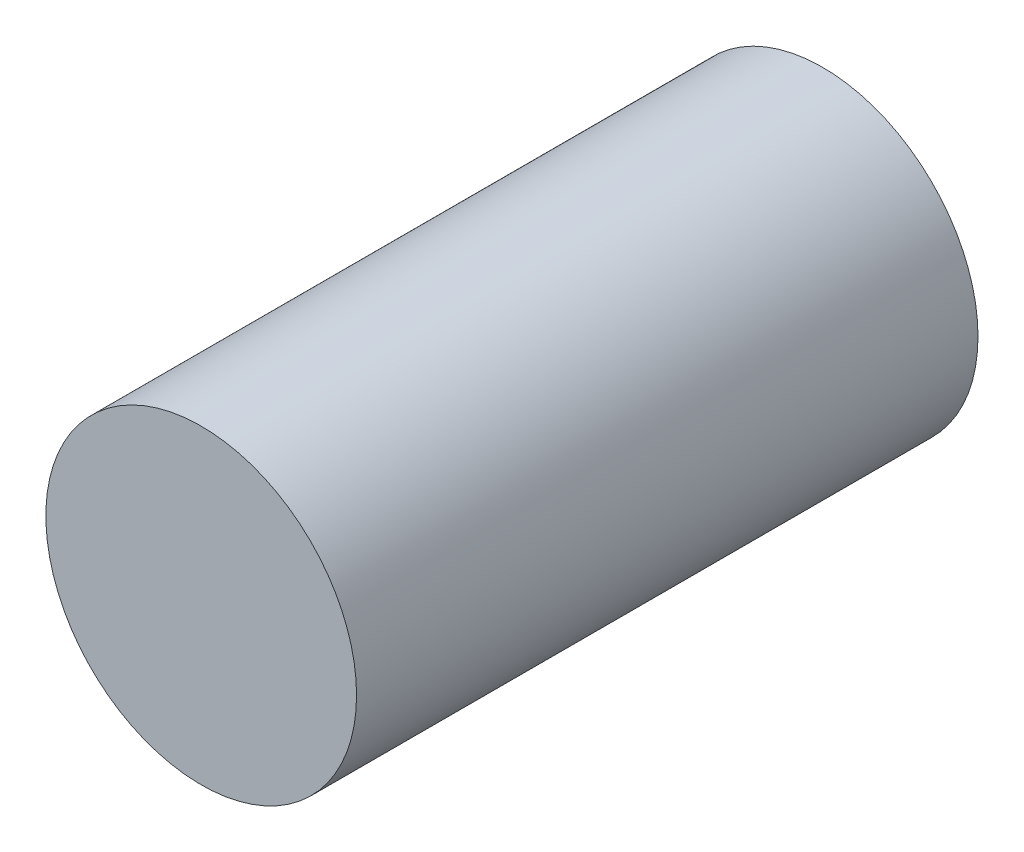
ISO-10303-21;
HEADER;
FILE_DESCRIPTION(('STEP AP214'),'2;1');
FILE_NAME('part.step','',(''),(''),'','','');
FILE_SCHEMA(('AUTOMOTIVE_DESIGN { 1 0 10303 214 1 1 1 1 }'));
ENDSEC;
DATA;
#1=APPLICATION_CONTEXT('core data for automotive mechanical design processes');
#2=APPLICATION_PROTOCOL_DEFINITION('international standard','automotive_design',2000,#1);
#3=PRODUCT_CONTEXT('',#1,'mechanical');
#4=PRODUCT('Part','Part','',(#3));
#5=PRODUCT_RELATED_PRODUCT_CATEGORY('part','',(#4));
#6=PRODUCT_DEFINITION_FORMATION('','',#4);
#7=PRODUCT_DEFINITION_CONTEXT('part definition',#1,'design');
#8=PRODUCT_DEFINITION('design','',#6,#7);
#9=PRODUCT_DEFINITION_SHAPE('','',#8);
#10=(LENGTH_UNIT() NAMED_UNIT(*) SI_UNIT(.MILLI.,.METRE.));
#11=(NAMED_UNIT(*) PLANE_ANGLE_UNIT() SI_UNIT($,.RADIAN.));
#12=(NAMED_UNIT(*) SI_UNIT($,.STERADIAN.) SOLID_ANGLE_UNIT());
#13=UNCERTAINTY_MEASURE_WITH_UNIT(LENGTH_MEASURE(1.E-05),#10,'distance_accuracy_value','');
#14=(GEOMETRIC_REPRESENTATION_CONTEXT(3) GLOBAL_UNCERTAINTY_ASSIGNED_CONTEXT((#13)) GLOBAL_UNIT_ASSIGNED_CONTEXT((#10,
#11,#12)) REPRESENTATION_CONTEXT('',''));
#15=CARTESIAN_POINT('',(0.,0.,0.));
#16=DIRECTION('',(0.,0.,1.));
#17=DIRECTION('',(1.,0.,0.));
#18=AXIS2_PLACEMENT_3D('',#15,#16,#17);
#19=CARTESIAN_POINT('',(0.,0.,80.));
#20=DIRECTION('',(0.,0.,-1.));
#21=DIRECTION('',(-1.,0.,0.));
#22=AXIS2_PLACEMENT_3D('',#19,#20,#21);
#23=CYLINDRICAL_SURFACE('',#22,20.);
#24=CARTESIAN_POINT('',(0.,0.,80.));
#25=DIRECTION('',(0.,0.,1.));
#26=DIRECTION('',(1.,0.,0.));
#27=AXIS2_PLACEMENT_3D('',#24,#25,#26);
#28=CIRCLE('',#27,20.);
#29=CARTESIAN_POINT('',(20.,0.,80.));
#30=VERTEX_POINT('',#29);
#31=EDGE_CURVE('E10',#30,#30,#28,.T.);
#32=ORIENTED_EDGE('',*,*,#31,.F.);
#33=EDGE_LOOP('',(#32));
#34=FACE_BOUND('',#33,.T.);
#35=CARTESIAN_POINT('',(0.,0.,0.));
#36=DIRECTION('',(0.,0.,1.));
#37=DIRECTION('',(1.,0.,0.));
#38=AXIS2_PLACEMENT_3D('',#35,#36,#37);
#39=CIRCLE('',#38,20.);
#40=CARTESIAN_POINT('',(20.,0.,0.));
#41=VERTEX_POINT('',#40);
#42=EDGE_CURVE('E40',#41,#41,#39,.T.);
#43=ORIENTED_EDGE('',*,*,#42,.T.);
#44=EDGE_LOOP('',(#43));
#45=FACE_BOUND('',#44,.T.);
#46=ADVANCED_FACE('F37',(#34,#45),#23,.T.);
#47=CARTESIAN_POINT('',(0.,0.,80.));
#48=DIRECTION('',(0.,0.,1.));
#49=DIRECTION('',(1.,0.,0.));
#50=AXIS2_PLACEMENT_3D('',#47,#48,#49);
#51=PLANE('',#50);
#52=ORIENTED_EDGE('',*,*,#31,.T.);
#53=EDGE_LOOP('',(#52));
#54=FACE_BOUND('',#53,.T.);
#55=ADVANCED_FACE('F54',(#54),#51,.T.);
#56=CARTESIAN_POINT('',(0.,0.,0.));
#57=DIRECTION('',(0.,0.,1.));
#58=DIRECTION('',(1.,0.,0.));
#59=AXIS2_PLACEMENT_3D('',#56,#57,#58);
#60=PLANE('',#59);
#61=ORIENTED_EDGE('',*,*,#42,.F.);
#62=EDGE_LOOP('',(#61));
#63=FACE_BOUND('',#62,.T.);
#64=ADVANCED_FACE('F52',(#63),#60,.F.);
#65=CLOSED_SHELL('',(#46,#55,#64));
#66=MANIFOLD_SOLID_BREP('B2',#65);
#67=ADVANCED_BREP_SHAPE_REPRESENTATION('',(#18,#66),#14);
#68=SHAPE_DEFINITION_REPRESENTATION(#9,#67);
ENDSEC;
END-ISO-10303-21;
